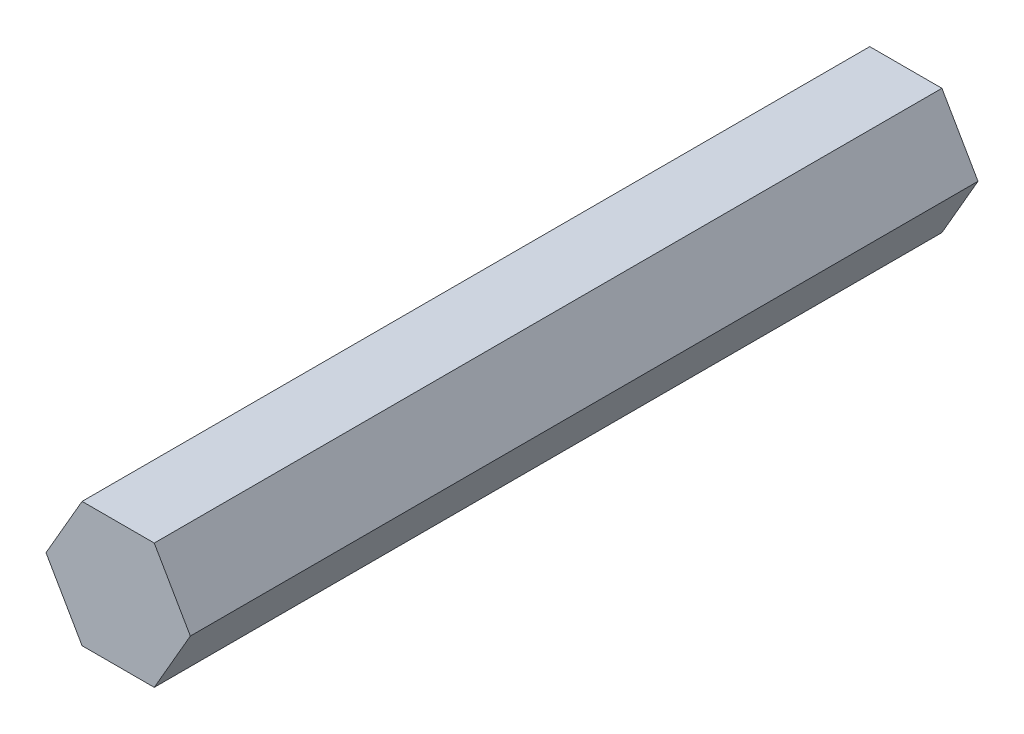
ISO-10303-21;
HEADER;
FILE_DESCRIPTION(('STEP AP214'),'2;1');
FILE_NAME('part.step','',(''),(''),'','','');
FILE_SCHEMA(('AUTOMOTIVE_DESIGN { 1 0 10303 214 1 1 1 1 }'));
ENDSEC;
DATA;
#1=APPLICATION_CONTEXT('core data for automotive mechanical design processes');
#2=APPLICATION_PROTOCOL_DEFINITION('international standard','automotive_design',2000,#1);
#3=PRODUCT_CONTEXT('',#1,'mechanical');
#4=PRODUCT('Part','Part','',(#3));
#5=PRODUCT_RELATED_PRODUCT_CATEGORY('part','',(#4));
#6=PRODUCT_DEFINITION_FORMATION('','',#4);
#7=PRODUCT_DEFINITION_CONTEXT('part definition',#1,'design');
#8=PRODUCT_DEFINITION('design','',#6,#7);
#9=PRODUCT_DEFINITION_SHAPE('','',#8);
#10=(LENGTH_UNIT() NAMED_UNIT(*) SI_UNIT(.MILLI.,.METRE.));
#11=(NAMED_UNIT(*) PLANE_ANGLE_UNIT() SI_UNIT($,.RADIAN.));
#12=(NAMED_UNIT(*) SI_UNIT($,.STERADIAN.) SOLID_ANGLE_UNIT());
#13=UNCERTAINTY_MEASURE_WITH_UNIT(LENGTH_MEASURE(1.E-05),#10,'distance_accuracy_value','');
#14=(GEOMETRIC_REPRESENTATION_CONTEXT(3) GLOBAL_UNCERTAINTY_ASSIGNED_CONTEXT((#13)) GLOBAL_UNIT_ASSIGNED_CONTEXT((#10,
#11,#12)) REPRESENTATION_CONTEXT('',''));
#15=CARTESIAN_POINT('',(0.,0.,0.));
#16=DIRECTION('',(0.,0.,1.));
#17=DIRECTION('',(1.,0.,0.));
#18=AXIS2_PLACEMENT_3D('',#15,#16,#17);
#19=CARTESIAN_POINT('',(3.665,6.34796620973994,80.));
#20=DIRECTION('',(0.,-1.,0.));
#21=DIRECTION('',(0.,0.,-1.));
#22=AXIS2_PLACEMENT_3D('',#19,#20,#21);
#23=PLANE('',#22);
#24=DIRECTION('',(-1.,0.,0.));
#25=VECTOR('',#24,1.);
#26=CARTESIAN_POINT('',(3.665,6.34796620973994,0.));
#27=LINE('',#26,#25);
#28=CARTESIAN_POINT('',(3.665,6.34796620973994,0.));
#29=VERTEX_POINT('',#28);
#30=CARTESIAN_POINT('',(-3.665,6.34796620973994,0.));
#31=VERTEX_POINT('',#30);
#32=EDGE_CURVE('E117',#29,#31,#27,.T.);
#33=ORIENTED_EDGE('',*,*,#32,.T.);
#34=DIRECTION('',(0.,0.,-1.));
#35=VECTOR('',#34,1.);
#36=CARTESIAN_POINT('',(-3.665,6.34796620973994,80.));
#37=LINE('',#36,#35);
#38=CARTESIAN_POINT('',(-3.665,6.34796620973994,80.));
#39=VERTEX_POINT('',#38);
#40=EDGE_CURVE('E11',#39,#31,#37,.T.);
#41=ORIENTED_EDGE('',*,*,#40,.F.);
#42=DIRECTION('',(-1.,0.,0.));
#43=VECTOR('',#42,1.);
#44=CARTESIAN_POINT('',(3.665,6.34796620973994,80.));
#45=LINE('',#44,#43);
#46=CARTESIAN_POINT('',(3.665,6.34796620973994,80.));
#47=VERTEX_POINT('',#46);
#48=EDGE_CURVE('E127',#47,#39,#45,.T.);
#49=ORIENTED_EDGE('',*,*,#48,.F.);
#50=DIRECTION('',(0.,0.,-1.));
#51=VECTOR('',#50,1.);
#52=CARTESIAN_POINT('',(3.665,6.34796620973994,80.));
#53=LINE('',#52,#51);
#54=EDGE_CURVE('E113',#47,#29,#53,.T.);
#55=ORIENTED_EDGE('',*,*,#54,.T.);
#56=EDGE_LOOP('',(#33,#41,#49,#55));
#57=FACE_BOUND('',#56,.T.);
#58=ADVANCED_FACE('F33',(#57),#23,.F.);
#59=CARTESIAN_POINT('',(-3.665,6.34796620973994,80.));
#60=DIRECTION('',(0.866025403784439,-0.5,0.));
#61=DIRECTION('',(0.5,0.866025403784439,0.));
#62=AXIS2_PLACEMENT_3D('',#59,#60,#61);
#63=PLANE('',#62);
#64=DIRECTION('',(-0.5,-0.866025403784438,0.));
#65=VECTOR('',#64,1.);
#66=CARTESIAN_POINT('',(-3.665,6.34796620973994,0.));
#67=LINE('',#66,#65);
#68=CARTESIAN_POINT('',(-7.33,0.,0.));
#69=VERTEX_POINT('',#68);
#70=EDGE_CURVE('E120',#31,#69,#67,.T.);
#71=ORIENTED_EDGE('',*,*,#70,.T.);
#72=DIRECTION('',(0.,0.,-1.));
#73=VECTOR('',#72,1.);
#74=CARTESIAN_POINT('',(-7.33,0.,80.));
#75=LINE('',#74,#73);
#76=CARTESIAN_POINT('',(-7.33,0.,80.));
#77=VERTEX_POINT('',#76);
#78=EDGE_CURVE('E41',#77,#69,#75,.T.);
#79=ORIENTED_EDGE('',*,*,#78,.F.);
#80=DIRECTION('',(-0.5,-0.866025403784438,0.));
#81=VECTOR('',#80,1.);
#82=CARTESIAN_POINT('',(-3.665,6.34796620973994,80.));
#83=LINE('',#82,#81);
#84=EDGE_CURVE('E86',#39,#77,#83,.T.);
#85=ORIENTED_EDGE('',*,*,#84,.F.);
#86=ORIENTED_EDGE('',*,*,#40,.T.);
#87=EDGE_LOOP('',(#71,#79,#85,#86));
#88=FACE_BOUND('',#87,.T.);
#89=ADVANCED_FACE('F151',(#88),#63,.F.);
#90=CARTESIAN_POINT('',(-7.33,0.,80.));
#91=DIRECTION('',(0.866025403784439,0.5,0.));
#92=DIRECTION('',(-0.5,0.866025403784439,0.));
#93=AXIS2_PLACEMENT_3D('',#90,#91,#92);
#94=PLANE('',#93);
#95=DIRECTION('',(0.5,-0.866025403784439,0.));
#96=VECTOR('',#95,1.);
#97=CARTESIAN_POINT('',(-7.33,0.,0.));
#98=LINE('',#97,#96);
#99=CARTESIAN_POINT('',(-3.665,-6.34796620973994,0.));
#100=VERTEX_POINT('',#99);
#101=EDGE_CURVE('E122',#69,#100,#98,.T.);
#102=ORIENTED_EDGE('',*,*,#101,.T.);
#103=DIRECTION('',(0.,0.,-1.));
#104=VECTOR('',#103,1.);
#105=CARTESIAN_POINT('',(-3.665,-6.34796620973994,80.));
#106=LINE('',#105,#104);
#107=CARTESIAN_POINT('',(-3.665,-6.34796620973994,80.));
#108=VERTEX_POINT('',#107);
#109=EDGE_CURVE('E108',#108,#100,#106,.T.);
#110=ORIENTED_EDGE('',*,*,#109,.F.);
#111=DIRECTION('',(0.5,-0.866025403784439,0.));
#112=VECTOR('',#111,1.);
#113=CARTESIAN_POINT('',(-7.33,0.,80.));
#114=LINE('',#113,#112);
#115=EDGE_CURVE('E99',#77,#108,#114,.T.);
#116=ORIENTED_EDGE('',*,*,#115,.F.);
#117=ORIENTED_EDGE('',*,*,#78,.T.);
#118=EDGE_LOOP('',(#102,#110,#116,#117));
#119=FACE_BOUND('',#118,.T.);
#120=ADVANCED_FACE('F133',(#119),#94,.F.);
#121=CARTESIAN_POINT('',(-3.665,-6.34796620973994,80.));
#122=DIRECTION('',(0.,1.,0.));
#123=DIRECTION('',(0.,0.,1.));
#124=AXIS2_PLACEMENT_3D('',#121,#122,#123);
#125=PLANE('',#124);
#126=DIRECTION('',(1.,0.,0.));
#127=VECTOR('',#126,1.);
#128=CARTESIAN_POINT('',(-3.665,-6.34796620973994,0.));
#129=LINE('',#128,#127);
#130=CARTESIAN_POINT('',(3.665,-6.34796620973994,0.));
#131=VERTEX_POINT('',#130);
#132=EDGE_CURVE('E107',#100,#131,#129,.T.);
#133=ORIENTED_EDGE('',*,*,#132,.T.);
#134=DIRECTION('',(0.,0.,-1.));
#135=VECTOR('',#134,1.);
#136=CARTESIAN_POINT('',(3.665,-6.34796620973994,80.));
#137=LINE('',#136,#135);
#138=CARTESIAN_POINT('',(3.665,-6.34796620973994,80.));
#139=VERTEX_POINT('',#138);
#140=EDGE_CURVE('E104',#139,#131,#137,.T.);
#141=ORIENTED_EDGE('',*,*,#140,.F.);
#142=DIRECTION('',(1.,0.,0.));
#143=VECTOR('',#142,1.);
#144=CARTESIAN_POINT('',(-3.665,-6.34796620973994,80.));
#145=LINE('',#144,#143);
#146=EDGE_CURVE('E93',#108,#139,#145,.T.);
#147=ORIENTED_EDGE('',*,*,#146,.F.);
#148=ORIENTED_EDGE('',*,*,#109,.T.);
#149=EDGE_LOOP('',(#133,#141,#147,#148));
#150=FACE_BOUND('',#149,.T.);
#151=ADVANCED_FACE('F105',(#150),#125,.F.);
#152=CARTESIAN_POINT('',(3.665,-6.34796620973994,80.));
#153=DIRECTION('',(-0.866025403784439,0.5,0.));
#154=DIRECTION('',(-0.5,-0.866025403784439,0.));
#155=AXIS2_PLACEMENT_3D('',#152,#153,#154);
#156=PLANE('',#155);
#157=DIRECTION('',(0.5,0.866025403784439,0.));
#158=VECTOR('',#157,1.);
#159=CARTESIAN_POINT('',(3.665,-6.34796620973994,0.));
#160=LINE('',#159,#158);
#161=CARTESIAN_POINT('',(7.33,0.,0.));
#162=VERTEX_POINT('',#161);
#163=EDGE_CURVE('E72',#131,#162,#160,.T.);
#164=ORIENTED_EDGE('',*,*,#163,.T.);
#165=DIRECTION('',(0.,0.,-1.));
#166=VECTOR('',#165,1.);
#167=CARTESIAN_POINT('',(7.33,0.,80.));
#168=LINE('',#167,#166);
#169=CARTESIAN_POINT('',(7.33,0.,80.));
#170=VERTEX_POINT('',#169);
#171=EDGE_CURVE('E109',#170,#162,#168,.T.);
#172=ORIENTED_EDGE('',*,*,#171,.F.);
#173=DIRECTION('',(0.5,0.866025403784439,0.));
#174=VECTOR('',#173,1.);
#175=CARTESIAN_POINT('',(3.665,-6.34796620973994,80.));
#176=LINE('',#175,#174);
#177=EDGE_CURVE('E97',#139,#170,#176,.T.);
#178=ORIENTED_EDGE('',*,*,#177,.F.);
#179=ORIENTED_EDGE('',*,*,#140,.T.);
#180=EDGE_LOOP('',(#164,#172,#178,#179));
#181=FACE_BOUND('',#180,.T.);
#182=ADVANCED_FACE('F111',(#181),#156,.F.);
#183=CARTESIAN_POINT('',(7.33,0.,80.));
#184=DIRECTION('',(-0.866025403784439,-0.5,0.));
#185=DIRECTION('',(0.5,-0.866025403784439,0.));
#186=AXIS2_PLACEMENT_3D('',#183,#184,#185);
#187=PLANE('',#186);
#188=DIRECTION('',(-0.5,0.866025403784439,0.));
#189=VECTOR('',#188,1.);
#190=CARTESIAN_POINT('',(7.33,0.,0.));
#191=LINE('',#190,#189);
#192=EDGE_CURVE('E78',#162,#29,#191,.T.);
#193=ORIENTED_EDGE('',*,*,#192,.T.);
#194=ORIENTED_EDGE('',*,*,#54,.F.);
#195=DIRECTION('',(-0.5,0.866025403784439,0.));
#196=VECTOR('',#195,1.);
#197=CARTESIAN_POINT('',(7.33,0.,80.));
#198=LINE('',#197,#196);
#199=EDGE_CURVE('E49',#170,#47,#198,.T.);
#200=ORIENTED_EDGE('',*,*,#199,.F.);
#201=ORIENTED_EDGE('',*,*,#171,.T.);
#202=EDGE_LOOP('',(#193,#194,#200,#201));
#203=FACE_BOUND('',#202,.T.);
#204=ADVANCED_FACE('F140',(#203),#187,.F.);
#205=CARTESIAN_POINT('',(0.,0.,80.));
#206=DIRECTION('',(0.,0.,1.));
#207=DIRECTION('',(1.,0.,0.));
#208=AXIS2_PLACEMENT_3D('',#205,#206,#207);
#209=PLANE('',#208);
#210=ORIENTED_EDGE('',*,*,#48,.T.);
#211=ORIENTED_EDGE('',*,*,#84,.T.);
#212=ORIENTED_EDGE('',*,*,#115,.T.);
#213=ORIENTED_EDGE('',*,*,#146,.T.);
#214=ORIENTED_EDGE('',*,*,#177,.T.);
#215=ORIENTED_EDGE('',*,*,#199,.T.);
#216=EDGE_LOOP('',(#210,#211,#212,#213,#214,#215));
#217=FACE_BOUND('',#216,.T.);
#218=ADVANCED_FACE('F95',(#217),#209,.T.);
#219=CARTESIAN_POINT('',(0.,0.,0.));
#220=DIRECTION('',(0.,0.,1.));
#221=DIRECTION('',(1.,0.,0.));
#222=AXIS2_PLACEMENT_3D('',#219,#220,#221);
#223=PLANE('',#222);
#224=ORIENTED_EDGE('',*,*,#32,.F.);
#225=ORIENTED_EDGE('',*,*,#192,.F.);
#226=ORIENTED_EDGE('',*,*,#163,.F.);
#227=ORIENTED_EDGE('',*,*,#132,.F.);
#228=ORIENTED_EDGE('',*,*,#101,.F.);
#229=ORIENTED_EDGE('',*,*,#70,.F.);
#230=EDGE_LOOP('',(#224,#225,#226,#227,#228,#229));
#231=FACE_BOUND('',#230,.T.);
#232=ADVANCED_FACE('F136',(#231),#223,.F.);
#233=CLOSED_SHELL('',(#58,#89,#120,#151,#182,#204,#218,#232));
#234=MANIFOLD_SOLID_BREP('B2',#233);
#235=ADVANCED_BREP_SHAPE_REPRESENTATION('',(#18,#234),#14);
#236=SHAPE_DEFINITION_REPRESENTATION(#9,#235);
ENDSEC;
END-ISO-10303-21;
